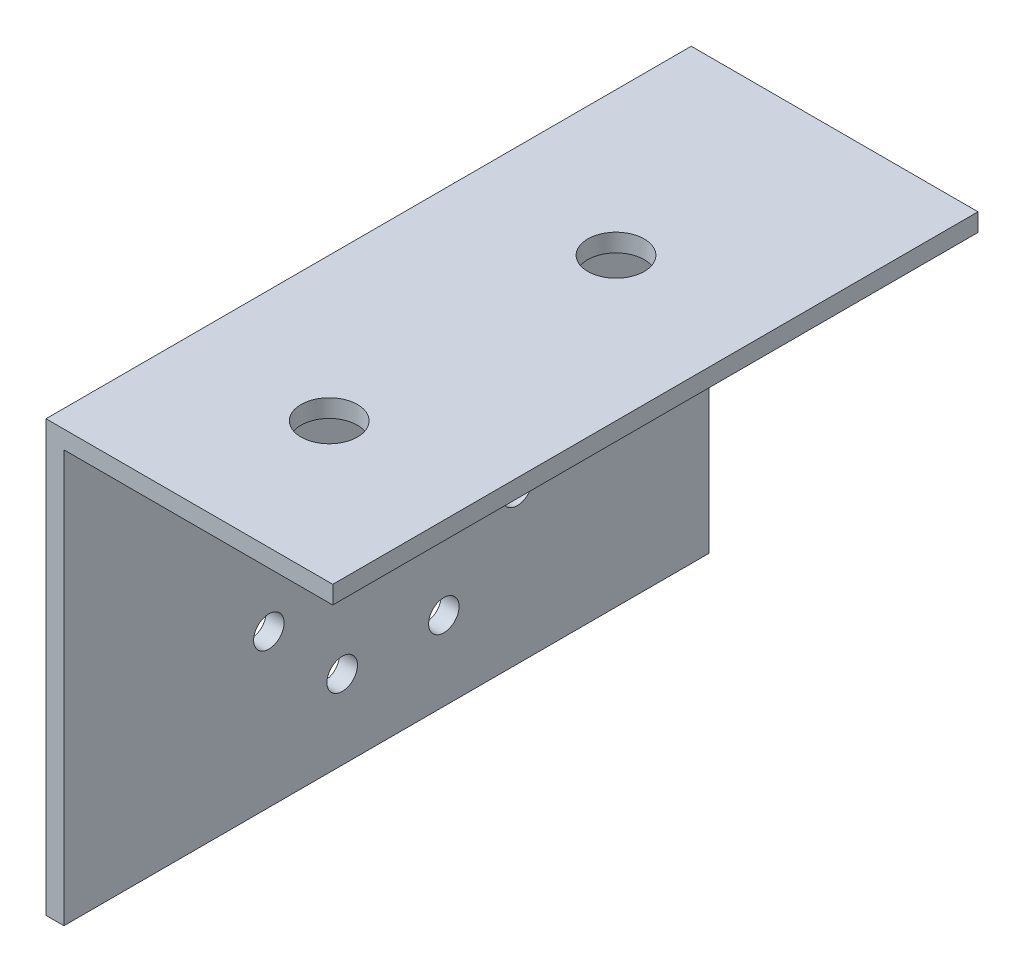
ISO-10303-21;
HEADER;
FILE_DESCRIPTION(('STEP AP214'),'2;1');
FILE_NAME('part.step','',(''),(''),'','','');
FILE_SCHEMA(('AUTOMOTIVE_DESIGN { 1 0 10303 214 1 1 1 1 }'));
ENDSEC;
DATA;
#1=APPLICATION_CONTEXT('core data for automotive mechanical design processes');
#2=APPLICATION_PROTOCOL_DEFINITION('international standard','automotive_design',2000,#1);
#3=PRODUCT_CONTEXT('',#1,'mechanical');
#4=PRODUCT('Part','Part','',(#3));
#5=PRODUCT_RELATED_PRODUCT_CATEGORY('part','',(#4));
#6=PRODUCT_DEFINITION_FORMATION('','',#4);
#7=PRODUCT_DEFINITION_CONTEXT('part definition',#1,'design');
#8=PRODUCT_DEFINITION('design','',#6,#7);
#9=PRODUCT_DEFINITION_SHAPE('','',#8);
#10=(LENGTH_UNIT() NAMED_UNIT(*) SI_UNIT(.MILLI.,.METRE.));
#11=(NAMED_UNIT(*) PLANE_ANGLE_UNIT() SI_UNIT($,.RADIAN.));
#12=(NAMED_UNIT(*) SI_UNIT($,.STERADIAN.) SOLID_ANGLE_UNIT());
#13=UNCERTAINTY_MEASURE_WITH_UNIT(LENGTH_MEASURE(1.E-05),#10,'distance_accuracy_value','');
#14=(GEOMETRIC_REPRESENTATION_CONTEXT(3) GLOBAL_UNCERTAINTY_ASSIGNED_CONTEXT((#13)) GLOBAL_UNIT_ASSIGNED_CONTEXT((#10,
#11,#12)) REPRESENTATION_CONTEXT('',''));
#15=CARTESIAN_POINT('',(0.,0.,0.));
#16=DIRECTION('',(0.,0.,1.));
#17=DIRECTION('',(1.,0.,0.));
#18=AXIS2_PLACEMENT_3D('',#15,#16,#17);
#19=CARTESIAN_POINT('',(-25.6516535121618,-10.7187266461533,57.15));
#20=DIRECTION('',(1.,0.,0.));
#21=DIRECTION('',(0.,0.,-1.));
#22=AXIS2_PLACEMENT_3D('',#19,#20,#21);
#23=PLANE('',#22);
#24=CARTESIAN_POINT('',(-25.6516535121618,-3.71872664615332,32.5));
#25=DIRECTION('',(1.,0.,0.));
#26=DIRECTION('',(0.,0.,-1.));
#27=AXIS2_PLACEMENT_3D('',#24,#25,#26);
#28=CIRCLE('',#27,1.35);
#29=CARTESIAN_POINT('',(-25.6516535121618,-3.71872664615332,31.15));
#30=VERTEX_POINT('',#29);
#31=EDGE_CURVE('E161',#30,#30,#28,.T.);
#32=ORIENTED_EDGE('',*,*,#31,.T.);
#33=EDGE_LOOP('',(#32));
#34=FACE_BOUND('',#33,.T.);
#35=CARTESIAN_POINT('',(-25.6516535121618,-3.71872664615332,23.5));
#36=DIRECTION('',(1.,0.,0.));
#37=DIRECTION('',(0.,0.,-1.));
#38=AXIS2_PLACEMENT_3D('',#35,#36,#37);
#39=CIRCLE('',#38,1.35);
#40=CARTESIAN_POINT('',(-25.6516535121618,-3.71872664615332,22.15));
#41=VERTEX_POINT('',#40);
#42=EDGE_CURVE('E165',#41,#41,#39,.T.);
#43=ORIENTED_EDGE('',*,*,#42,.T.);
#44=EDGE_LOOP('',(#43));
#45=FACE_BOUND('',#44,.T.);
#46=CARTESIAN_POINT('',(-25.6516535121618,2.78127335384669,16.9999999999998));
#47=DIRECTION('',(1.,0.,0.));
#48=DIRECTION('',(0.,0.,-1.));
#49=AXIS2_PLACEMENT_3D('',#46,#47,#48);
#50=CIRCLE('',#49,1.35);
#51=CARTESIAN_POINT('',(-25.6516535121618,2.78127335384669,15.6499999999998));
#52=VERTEX_POINT('',#51);
#53=EDGE_CURVE('E169',#52,#52,#50,.T.);
#54=ORIENTED_EDGE('',*,*,#53,.T.);
#55=EDGE_LOOP('',(#54));
#56=FACE_BOUND('',#55,.T.);
#57=CARTESIAN_POINT('',(-25.6516535121618,11.7812733538467,16.9999999999998));
#58=DIRECTION('',(1.,0.,0.));
#59=DIRECTION('',(0.,0.,-1.));
#60=AXIS2_PLACEMENT_3D('',#57,#58,#59);
#61=CIRCLE('',#60,1.35);
#62=CARTESIAN_POINT('',(-25.6516535121618,11.7812733538467,15.6499999999998));
#63=VERTEX_POINT('',#62);
#64=EDGE_CURVE('E173',#63,#63,#61,.T.);
#65=ORIENTED_EDGE('',*,*,#64,.T.);
#66=EDGE_LOOP('',(#65));
#67=FACE_BOUND('',#66,.T.);
#68=CARTESIAN_POINT('',(-25.6516535121618,18.2812733538467,23.5));
#69=DIRECTION('',(1.,0.,0.));
#70=DIRECTION('',(0.,0.,-1.));
#71=AXIS2_PLACEMENT_3D('',#68,#69,#70);
#72=CIRCLE('',#71,1.35);
#73=CARTESIAN_POINT('',(-25.6516535121618,18.2812733538467,22.15));
#74=VERTEX_POINT('',#73);
#75=EDGE_CURVE('E177',#74,#74,#72,.T.);
#76=ORIENTED_EDGE('',*,*,#75,.T.);
#77=EDGE_LOOP('',(#76));
#78=FACE_BOUND('',#77,.T.);
#79=CARTESIAN_POINT('',(-25.6516535121618,18.2812733538467,32.5));
#80=DIRECTION('',(1.,0.,0.));
#81=DIRECTION('',(0.,0.,-1.));
#82=AXIS2_PLACEMENT_3D('',#79,#80,#81);
#83=CIRCLE('',#82,1.35);
#84=CARTESIAN_POINT('',(-25.6516535121618,18.2812733538467,31.15));
#85=VERTEX_POINT('',#84);
#86=EDGE_CURVE('E181',#85,#85,#83,.T.);
#87=ORIENTED_EDGE('',*,*,#86,.T.);
#88=EDGE_LOOP('',(#87));
#89=FACE_BOUND('',#88,.T.);
#90=CARTESIAN_POINT('',(-25.6516535121618,11.7812733538467,38.9999999999998));
#91=DIRECTION('',(1.,0.,0.));
#92=DIRECTION('',(0.,0.,-1.));
#93=AXIS2_PLACEMENT_3D('',#90,#91,#92);
#94=CIRCLE('',#93,1.35);
#95=CARTESIAN_POINT('',(-25.6516535121618,11.7812733538467,37.6499999999998));
#96=VERTEX_POINT('',#95);
#97=EDGE_CURVE('E185',#96,#96,#94,.T.);
#98=ORIENTED_EDGE('',*,*,#97,.T.);
#99=EDGE_LOOP('',(#98));
#100=FACE_BOUND('',#99,.T.);
#101=CARTESIAN_POINT('',(-25.6516535121618,2.78127335384667,38.9999999999998));
#102=DIRECTION('',(1.,0.,0.));
#103=DIRECTION('',(0.,0.,-1.));
#104=AXIS2_PLACEMENT_3D('',#101,#102,#103);
#105=CIRCLE('',#104,1.35);
#106=CARTESIAN_POINT('',(-25.6516535121618,2.78127335384667,37.6499999999998));
#107=VERTEX_POINT('',#106);
#108=EDGE_CURVE('E119',#107,#107,#105,.T.);
#109=ORIENTED_EDGE('',*,*,#108,.T.);
#110=EDGE_LOOP('',(#109));
#111=FACE_BOUND('',#110,.T.);
#112=DIRECTION('',(0.,-1.,0.));
#113=VECTOR('',#112,1.);
#114=CARTESIAN_POINT('',(-25.6516535121618,-10.7187266461533,0.));
#115=LINE('',#114,#113);
#116=CARTESIAN_POINT('',(-25.6516535121618,27.3812733538467,0.));
#117=VERTEX_POINT('',#116);
#118=CARTESIAN_POINT('',(-25.6516535121618,-10.7187266461533,0.));
#119=VERTEX_POINT('',#118);
#120=EDGE_CURVE('E115',#117,#119,#115,.T.);
#121=ORIENTED_EDGE('',*,*,#120,.T.);
#122=DIRECTION('',(0.,0.,-1.));
#123=VECTOR('',#122,1.);
#124=CARTESIAN_POINT('',(-25.6516535121618,-10.7187266461533,57.15));
#125=LINE('',#124,#123);
#126=CARTESIAN_POINT('',(-25.6516535121618,-10.7187266461533,57.15));
#127=VERTEX_POINT('',#126);
#128=EDGE_CURVE('E11',#127,#119,#125,.T.);
#129=ORIENTED_EDGE('',*,*,#128,.F.);
#130=DIRECTION('',(0.,-1.,0.));
#131=VECTOR('',#130,1.);
#132=CARTESIAN_POINT('',(-25.6516535121618,-10.7187266461533,57.15));
#133=LINE('',#132,#131);
#134=CARTESIAN_POINT('',(-25.6516535121618,27.3812733538467,57.15));
#135=VERTEX_POINT('',#134);
#136=EDGE_CURVE('E126',#135,#127,#133,.T.);
#137=ORIENTED_EDGE('',*,*,#136,.F.);
#138=DIRECTION('',(0.,0.,-1.));
#139=VECTOR('',#138,1.);
#140=CARTESIAN_POINT('',(-25.6516535121618,27.3812733538467,57.15));
#141=LINE('',#140,#139);
#142=EDGE_CURVE('E111',#135,#117,#141,.T.);
#143=ORIENTED_EDGE('',*,*,#142,.T.);
#144=EDGE_LOOP('',(#121,#129,#137,#143));
#145=FACE_BOUND('',#144,.T.);
#146=ADVANCED_FACE('F31',(#34,#45,#56,#67,#78,#89,#100,#111,#145),#23,.F.);
#147=CARTESIAN_POINT('',(-25.6516535121618,-10.7187266461533,57.15));
#148=DIRECTION('',(0.,1.,0.));
#149=DIRECTION('',(0.,0.,1.));
#150=AXIS2_PLACEMENT_3D('',#147,#148,#149);
#151=PLANE('',#150);
#152=DIRECTION('',(1.,0.,0.));
#153=VECTOR('',#152,1.);
#154=CARTESIAN_POINT('',(-25.6516535121618,-10.7187266461533,0.));
#155=LINE('',#154,#153);
#156=CARTESIAN_POINT('',(-24.0641535121618,-10.7187266461533,0.));
#157=VERTEX_POINT('',#156);
#158=EDGE_CURVE('E118',#119,#157,#155,.T.);
#159=ORIENTED_EDGE('',*,*,#158,.T.);
#160=DIRECTION('',(0.,0.,-1.));
#161=VECTOR('',#160,1.);
#162=CARTESIAN_POINT('',(-24.0641535121618,-10.7187266461533,57.15));
#163=LINE('',#162,#161);
#164=CARTESIAN_POINT('',(-24.0641535121618,-10.7187266461533,57.15));
#165=VERTEX_POINT('',#164);
#166=EDGE_CURVE('E39',#165,#157,#163,.T.);
#167=ORIENTED_EDGE('',*,*,#166,.F.);
#168=DIRECTION('',(1.,0.,0.));
#169=VECTOR('',#168,1.);
#170=CARTESIAN_POINT('',(-25.6516535121618,-10.7187266461533,57.15));
#171=LINE('',#170,#169);
#172=EDGE_CURVE('E84',#127,#165,#171,.T.);
#173=ORIENTED_EDGE('',*,*,#172,.F.);
#174=ORIENTED_EDGE('',*,*,#128,.T.);
#175=EDGE_LOOP('',(#159,#167,#173,#174));
#176=FACE_BOUND('',#175,.T.);
#177=ADVANCED_FACE('F153',(#176),#151,.F.);
#178=CARTESIAN_POINT('',(-24.0641535121618,-10.7187266461533,57.15));
#179=DIRECTION('',(-1.,0.,0.));
#180=DIRECTION('',(0.,0.,1.));
#181=AXIS2_PLACEMENT_3D('',#178,#179,#180);
#182=PLANE('',#181);
#183=CARTESIAN_POINT('',(-24.0641535121618,-3.71872664615332,32.5));
#184=DIRECTION('',(1.,0.,0.));
#185=DIRECTION('',(0.,0.,-1.));
#186=AXIS2_PLACEMENT_3D('',#183,#184,#185);
#187=CIRCLE('',#186,1.35);
#188=CARTESIAN_POINT('',(-24.0641535121618,-3.71872664615332,31.15));
#189=VERTEX_POINT('',#188);
#190=EDGE_CURVE('E218',#189,#189,#187,.T.);
#191=ORIENTED_EDGE('',*,*,#190,.F.);
#192=EDGE_LOOP('',(#191));
#193=FACE_BOUND('',#192,.T.);
#194=CARTESIAN_POINT('',(-24.0641535121618,-3.71872664615332,23.5));
#195=DIRECTION('',(1.,0.,0.));
#196=DIRECTION('',(0.,0.,-1.));
#197=AXIS2_PLACEMENT_3D('',#194,#195,#196);
#198=CIRCLE('',#197,1.35);
#199=CARTESIAN_POINT('',(-24.0641535121618,-3.71872664615332,22.15));
#200=VERTEX_POINT('',#199);
#201=EDGE_CURVE('E214',#200,#200,#198,.T.);
#202=ORIENTED_EDGE('',*,*,#201,.F.);
#203=EDGE_LOOP('',(#202));
#204=FACE_BOUND('',#203,.T.);
#205=CARTESIAN_POINT('',(-24.0641535121618,2.78127335384669,16.9999999999998));
#206=DIRECTION('',(1.,0.,0.));
#207=DIRECTION('',(0.,0.,-1.));
#208=AXIS2_PLACEMENT_3D('',#205,#206,#207);
#209=CIRCLE('',#208,1.35);
#210=CARTESIAN_POINT('',(-24.0641535121618,2.78127335384669,15.6499999999998));
#211=VERTEX_POINT('',#210);
#212=EDGE_CURVE('E210',#211,#211,#209,.T.);
#213=ORIENTED_EDGE('',*,*,#212,.F.);
#214=EDGE_LOOP('',(#213));
#215=FACE_BOUND('',#214,.T.);
#216=CARTESIAN_POINT('',(-24.0641535121618,11.7812733538467,16.9999999999998));
#217=DIRECTION('',(1.,0.,0.));
#218=DIRECTION('',(0.,0.,-1.));
#219=AXIS2_PLACEMENT_3D('',#216,#217,#218);
#220=CIRCLE('',#219,1.35);
#221=CARTESIAN_POINT('',(-24.0641535121618,11.7812733538467,15.6499999999998));
#222=VERTEX_POINT('',#221);
#223=EDGE_CURVE('E206',#222,#222,#220,.T.);
#224=ORIENTED_EDGE('',*,*,#223,.F.);
#225=EDGE_LOOP('',(#224));
#226=FACE_BOUND('',#225,.T.);
#227=CARTESIAN_POINT('',(-24.0641535121618,18.2812733538467,23.5));
#228=DIRECTION('',(1.,0.,0.));
#229=DIRECTION('',(0.,0.,-1.));
#230=AXIS2_PLACEMENT_3D('',#227,#228,#229);
#231=CIRCLE('',#230,1.35);
#232=CARTESIAN_POINT('',(-24.0641535121618,18.2812733538467,22.15));
#233=VERTEX_POINT('',#232);
#234=EDGE_CURVE('E202',#233,#233,#231,.T.);
#235=ORIENTED_EDGE('',*,*,#234,.F.);
#236=EDGE_LOOP('',(#235));
#237=FACE_BOUND('',#236,.T.);
#238=CARTESIAN_POINT('',(-24.0641535121618,18.2812733538467,32.5));
#239=DIRECTION('',(1.,0.,0.));
#240=DIRECTION('',(0.,0.,-1.));
#241=AXIS2_PLACEMENT_3D('',#238,#239,#240);
#242=CIRCLE('',#241,1.35);
#243=CARTESIAN_POINT('',(-24.0641535121618,18.2812733538467,31.15));
#244=VERTEX_POINT('',#243);
#245=EDGE_CURVE('E198',#244,#244,#242,.T.);
#246=ORIENTED_EDGE('',*,*,#245,.F.);
#247=EDGE_LOOP('',(#246));
#248=FACE_BOUND('',#247,.T.);
#249=CARTESIAN_POINT('',(-24.0641535121618,11.7812733538467,38.9999999999998));
#250=DIRECTION('',(1.,0.,0.));
#251=DIRECTION('',(0.,0.,-1.));
#252=AXIS2_PLACEMENT_3D('',#249,#250,#251);
#253=CIRCLE('',#252,1.35);
#254=CARTESIAN_POINT('',(-24.0641535121618,11.7812733538467,37.6499999999998));
#255=VERTEX_POINT('',#254);
#256=EDGE_CURVE('E192',#255,#255,#253,.T.);
#257=ORIENTED_EDGE('',*,*,#256,.F.);
#258=EDGE_LOOP('',(#257));
#259=FACE_BOUND('',#258,.T.);
#260=CARTESIAN_POINT('',(-24.0641535121618,2.78127335384667,38.9999999999998));
#261=DIRECTION('',(1.,0.,0.));
#262=DIRECTION('',(0.,0.,-1.));
#263=AXIS2_PLACEMENT_3D('',#260,#261,#262);
#264=CIRCLE('',#263,1.35);
#265=CARTESIAN_POINT('',(-24.0641535121618,2.78127335384667,37.6499999999998));
#266=VERTEX_POINT('',#265);
#267=EDGE_CURVE('E189',#266,#266,#264,.T.);
#268=ORIENTED_EDGE('',*,*,#267,.F.);
#269=EDGE_LOOP('',(#268));
#270=FACE_BOUND('',#269,.T.);
#271=DIRECTION('',(0.,1.,0.));
#272=VECTOR('',#271,1.);
#273=CARTESIAN_POINT('',(-24.0641535121618,-10.7187266461533,0.));
#274=LINE('',#273,#272);
#275=CARTESIAN_POINT('',(-24.0641535121618,25.7937733538467,0.));
#276=VERTEX_POINT('',#275);
#277=EDGE_CURVE('E121',#157,#276,#274,.T.);
#278=ORIENTED_EDGE('',*,*,#277,.T.);
#279=DIRECTION('',(0.,0.,-1.));
#280=VECTOR('',#279,1.);
#281=CARTESIAN_POINT('',(-24.0641535121618,25.7937733538467,57.15));
#282=LINE('',#281,#280);
#283=CARTESIAN_POINT('',(-24.0641535121618,25.7937733538467,57.15));
#284=VERTEX_POINT('',#283);
#285=EDGE_CURVE('E106',#284,#276,#282,.T.);
#286=ORIENTED_EDGE('',*,*,#285,.F.);
#287=DIRECTION('',(0.,1.,0.));
#288=VECTOR('',#287,1.);
#289=CARTESIAN_POINT('',(-24.0641535121618,-10.7187266461533,57.15));
#290=LINE('',#289,#288);
#291=EDGE_CURVE('E97',#165,#284,#290,.T.);
#292=ORIENTED_EDGE('',*,*,#291,.F.);
#293=ORIENTED_EDGE('',*,*,#166,.T.);
#294=EDGE_LOOP('',(#278,#286,#292,#293));
#295=FACE_BOUND('',#294,.T.);
#296=ADVANCED_FACE('F132',(#193,#204,#215,#226,#237,#248,#259,#270,#295),#182,.F.);
#297=CARTESIAN_POINT('',(-24.0641535121618,25.7937733538467,57.15));
#298=DIRECTION('',(0.,1.,0.));
#299=DIRECTION('',(0.,0.,1.));
#300=AXIS2_PLACEMENT_3D('',#297,#298,#299);
#301=PLANE('',#300);
#302=CARTESIAN_POINT('',(-12.9516535121618,25.7937733538467,19.362965599214));
#303=DIRECTION('',(0.,-1.,0.));
#304=DIRECTION('',(0.,0.,-1.));
#305=AXIS2_PLACEMENT_3D('',#302,#303,#304);
#306=CIRCLE('',#305,2.5);
#307=CARTESIAN_POINT('',(-12.9516535121618,25.7937733538467,16.862965599214));
#308=VERTEX_POINT('',#307);
#309=EDGE_CURVE('E231',#308,#308,#306,.T.);
#310=ORIENTED_EDGE('',*,*,#309,.F.);
#311=EDGE_LOOP('',(#310));
#312=FACE_BOUND('',#311,.T.);
#313=CARTESIAN_POINT('',(-12.9516535121618,25.7937733538467,44.762965599214));
#314=DIRECTION('',(0.,-1.,0.));
#315=DIRECTION('',(0.,0.,-1.));
#316=AXIS2_PLACEMENT_3D('',#313,#314,#315);
#317=CIRCLE('',#316,2.5);
#318=CARTESIAN_POINT('',(-12.9516535121618,25.7937733538467,42.262965599214));
#319=VERTEX_POINT('',#318);
#320=EDGE_CURVE('E225',#319,#319,#317,.T.);
#321=ORIENTED_EDGE('',*,*,#320,.F.);
#322=EDGE_LOOP('',(#321));
#323=FACE_BOUND('',#322,.T.);
#324=DIRECTION('',(1.,0.,0.));
#325=VECTOR('',#324,1.);
#326=CARTESIAN_POINT('',(-24.0641535121618,25.7937733538467,0.));
#327=LINE('',#326,#325);
#328=CARTESIAN_POINT('',(-0.251653512161782,25.7937733538467,0.));
#329=VERTEX_POINT('',#328);
#330=EDGE_CURVE('E105',#276,#329,#327,.T.);
#331=ORIENTED_EDGE('',*,*,#330,.T.);
#332=DIRECTION('',(0.,0.,-1.));
#333=VECTOR('',#332,1.);
#334=CARTESIAN_POINT('',(-0.251653512161782,25.7937733538467,57.15));
#335=LINE('',#334,#333);
#336=CARTESIAN_POINT('',(-0.251653512161782,25.7937733538467,57.15));
#337=VERTEX_POINT('',#336);
#338=EDGE_CURVE('E102',#337,#329,#335,.T.);
#339=ORIENTED_EDGE('',*,*,#338,.F.);
#340=DIRECTION('',(1.,0.,0.));
#341=VECTOR('',#340,1.);
#342=CARTESIAN_POINT('',(-24.0641535121618,25.7937733538467,57.15));
#343=LINE('',#342,#341);
#344=EDGE_CURVE('E91',#284,#337,#343,.T.);
#345=ORIENTED_EDGE('',*,*,#344,.F.);
#346=ORIENTED_EDGE('',*,*,#285,.T.);
#347=EDGE_LOOP('',(#331,#339,#345,#346));
#348=FACE_BOUND('',#347,.T.);
#349=ADVANCED_FACE('F103',(#312,#323,#348),#301,.F.);
#350=CARTESIAN_POINT('',(-0.251653512161783,27.3812733538467,57.15));
#351=DIRECTION('',(-1.,0.,0.));
#352=DIRECTION('',(0.,-1.,0.));
#353=AXIS2_PLACEMENT_3D('',#350,#351,#352);
#354=PLANE('',#353);
#355=DIRECTION('',(0.,1.,0.));
#356=VECTOR('',#355,1.);
#357=CARTESIAN_POINT('',(-0.251653512161783,27.3812733538467,0.));
#358=LINE('',#357,#356);
#359=CARTESIAN_POINT('',(-0.251653512161783,27.3812733538467,0.));
#360=VERTEX_POINT('',#359);
#361=EDGE_CURVE('E70',#329,#360,#358,.T.);
#362=ORIENTED_EDGE('',*,*,#361,.T.);
#363=DIRECTION('',(0.,0.,-1.));
#364=VECTOR('',#363,1.);
#365=CARTESIAN_POINT('',(-0.251653512161783,27.3812733538467,57.15));
#366=LINE('',#365,#364);
#367=CARTESIAN_POINT('',(-0.251653512161783,27.3812733538467,57.15));
#368=VERTEX_POINT('',#367);
#369=EDGE_CURVE('E107',#368,#360,#366,.T.);
#370=ORIENTED_EDGE('',*,*,#369,.F.);
#371=DIRECTION('',(0.,1.,0.));
#372=VECTOR('',#371,1.);
#373=CARTESIAN_POINT('',(-0.251653512161783,27.3812733538467,57.15));
#374=LINE('',#373,#372);
#375=EDGE_CURVE('E95',#337,#368,#374,.T.);
#376=ORIENTED_EDGE('',*,*,#375,.F.);
#377=ORIENTED_EDGE('',*,*,#338,.T.);
#378=EDGE_LOOP('',(#362,#370,#376,#377));
#379=FACE_BOUND('',#378,.T.);
#380=ADVANCED_FACE('F109',(#379),#354,.F.);
#381=CARTESIAN_POINT('',(-0.251653512161783,27.3812733538467,57.15));
#382=DIRECTION('',(0.,-1.,0.));
#383=DIRECTION('',(1.,0.,0.));
#384=AXIS2_PLACEMENT_3D('',#381,#382,#383);
#385=PLANE('',#384);
#386=CARTESIAN_POINT('',(-12.9516535121618,27.3812733538467,19.362965599214));
#387=DIRECTION('',(0.,-1.,0.));
#388=DIRECTION('',(0.,0.,-1.));
#389=AXIS2_PLACEMENT_3D('',#386,#387,#388);
#390=CIRCLE('',#389,2.5);
#391=CARTESIAN_POINT('',(-12.9516535121618,27.3812733538467,16.862965599214));
#392=VERTEX_POINT('',#391);
#393=EDGE_CURVE('E228',#392,#392,#390,.T.);
#394=ORIENTED_EDGE('',*,*,#393,.T.);
#395=EDGE_LOOP('',(#394));
#396=FACE_BOUND('',#395,.T.);
#397=CARTESIAN_POINT('',(-12.9516535121618,27.3812733538467,44.762965599214));
#398=DIRECTION('',(0.,-1.,0.));
#399=DIRECTION('',(0.,0.,-1.));
#400=AXIS2_PLACEMENT_3D('',#397,#398,#399);
#401=CIRCLE('',#400,2.5);
#402=CARTESIAN_POINT('',(-12.9516535121618,27.3812733538467,42.262965599214));
#403=VERTEX_POINT('',#402);
#404=EDGE_CURVE('E222',#403,#403,#401,.T.);
#405=ORIENTED_EDGE('',*,*,#404,.T.);
#406=EDGE_LOOP('',(#405));
#407=FACE_BOUND('',#406,.T.);
#408=DIRECTION('',(-1.,0.,0.));
#409=VECTOR('',#408,1.);
#410=CARTESIAN_POINT('',(-0.251653512161783,27.3812733538467,0.));
#411=LINE('',#410,#409);
#412=EDGE_CURVE('E76',#360,#117,#411,.T.);
#413=ORIENTED_EDGE('',*,*,#412,.T.);
#414=ORIENTED_EDGE('',*,*,#142,.F.);
#415=DIRECTION('',(-1.,0.,0.));
#416=VECTOR('',#415,1.);
#417=CARTESIAN_POINT('',(-0.251653512161783,27.3812733538467,57.15));
#418=LINE('',#417,#416);
#419=EDGE_CURVE('E47',#368,#135,#418,.T.);
#420=ORIENTED_EDGE('',*,*,#419,.F.);
#421=ORIENTED_EDGE('',*,*,#369,.T.);
#422=EDGE_LOOP('',(#413,#414,#420,#421));
#423=FACE_BOUND('',#422,.T.);
#424=ADVANCED_FACE('F139',(#396,#407,#423),#385,.F.);
#425=CARTESIAN_POINT('',(-25.6516535121618,27.3812733538467,57.15));
#426=DIRECTION('',(0.,0.,1.));
#427=DIRECTION('',(1.,0.,0.));
#428=AXIS2_PLACEMENT_3D('',#425,#426,#427);
#429=PLANE('',#428);
#430=ORIENTED_EDGE('',*,*,#136,.T.);
#431=ORIENTED_EDGE('',*,*,#172,.T.);
#432=ORIENTED_EDGE('',*,*,#291,.T.);
#433=ORIENTED_EDGE('',*,*,#344,.T.);
#434=ORIENTED_EDGE('',*,*,#375,.T.);
#435=ORIENTED_EDGE('',*,*,#419,.T.);
#436=EDGE_LOOP('',(#430,#431,#432,#433,#434,#435));
#437=FACE_BOUND('',#436,.T.);
#438=ADVANCED_FACE('F93',(#437),#429,.T.);
#439=CARTESIAN_POINT('',(-25.6516535121618,27.3812733538467,0.));
#440=DIRECTION('',(0.,0.,1.));
#441=DIRECTION('',(1.,0.,0.));
#442=AXIS2_PLACEMENT_3D('',#439,#440,#441);
#443=PLANE('',#442);
#444=ORIENTED_EDGE('',*,*,#120,.F.);
#445=ORIENTED_EDGE('',*,*,#412,.F.);
#446=ORIENTED_EDGE('',*,*,#361,.F.);
#447=ORIENTED_EDGE('',*,*,#330,.F.);
#448=ORIENTED_EDGE('',*,*,#277,.F.);
#449=ORIENTED_EDGE('',*,*,#158,.F.);
#450=EDGE_LOOP('',(#444,#445,#446,#447,#448,#449));
#451=FACE_BOUND('',#450,.T.);
#452=ADVANCED_FACE('F135',(#451),#443,.F.);
#453=CARTESIAN_POINT('',(-25.6516535121618,2.78127335384667,38.9999999999998));
#454=DIRECTION('',(1.,0.,0.));
#455=DIRECTION('',(0.,0.,-1.));
#456=AXIS2_PLACEMENT_3D('',#453,#454,#455);
#457=CYLINDRICAL_SURFACE('',#456,1.35);
#458=ORIENTED_EDGE('',*,*,#108,.F.);
#459=EDGE_LOOP('',(#458));
#460=FACE_BOUND('',#459,.T.);
#461=ORIENTED_EDGE('',*,*,#267,.T.);
#462=EDGE_LOOP('',(#461));
#463=FACE_BOUND('',#462,.T.);
#464=ADVANCED_FACE('F282',(#460,#463),#457,.F.);
#465=CARTESIAN_POINT('',(-25.6516535121618,11.7812733538467,38.9999999999998));
#466=DIRECTION('',(1.,0.,0.));
#467=DIRECTION('',(0.,0.,-1.));
#468=AXIS2_PLACEMENT_3D('',#465,#466,#467);
#469=CYLINDRICAL_SURFACE('',#468,1.35);
#470=ORIENTED_EDGE('',*,*,#97,.F.);
#471=EDGE_LOOP('',(#470));
#472=FACE_BOUND('',#471,.T.);
#473=ORIENTED_EDGE('',*,*,#256,.T.);
#474=EDGE_LOOP('',(#473));
#475=FACE_BOUND('',#474,.T.);
#476=ADVANCED_FACE('F278',(#472,#475),#469,.F.);
#477=CARTESIAN_POINT('',(-25.6516535121618,18.2812733538467,32.5));
#478=DIRECTION('',(1.,0.,0.));
#479=DIRECTION('',(0.,0.,-1.));
#480=AXIS2_PLACEMENT_3D('',#477,#478,#479);
#481=CYLINDRICAL_SURFACE('',#480,1.35);
#482=ORIENTED_EDGE('',*,*,#86,.F.);
#483=EDGE_LOOP('',(#482));
#484=FACE_BOUND('',#483,.T.);
#485=ORIENTED_EDGE('',*,*,#245,.T.);
#486=EDGE_LOOP('',(#485));
#487=FACE_BOUND('',#486,.T.);
#488=ADVANCED_FACE('F274',(#484,#487),#481,.F.);
#489=CARTESIAN_POINT('',(-25.6516535121618,18.2812733538467,23.5));
#490=DIRECTION('',(1.,0.,0.));
#491=DIRECTION('',(0.,0.,-1.));
#492=AXIS2_PLACEMENT_3D('',#489,#490,#491);
#493=CYLINDRICAL_SURFACE('',#492,1.35);
#494=ORIENTED_EDGE('',*,*,#75,.F.);
#495=EDGE_LOOP('',(#494));
#496=FACE_BOUND('',#495,.T.);
#497=ORIENTED_EDGE('',*,*,#234,.T.);
#498=EDGE_LOOP('',(#497));
#499=FACE_BOUND('',#498,.T.);
#500=ADVANCED_FACE('F270',(#496,#499),#493,.F.);
#501=CARTESIAN_POINT('',(-25.6516535121618,11.7812733538467,16.9999999999998));
#502=DIRECTION('',(1.,0.,0.));
#503=DIRECTION('',(0.,0.,-1.));
#504=AXIS2_PLACEMENT_3D('',#501,#502,#503);
#505=CYLINDRICAL_SURFACE('',#504,1.35);
#506=ORIENTED_EDGE('',*,*,#64,.F.);
#507=EDGE_LOOP('',(#506));
#508=FACE_BOUND('',#507,.T.);
#509=ORIENTED_EDGE('',*,*,#223,.T.);
#510=EDGE_LOOP('',(#509));
#511=FACE_BOUND('',#510,.T.);
#512=ADVANCED_FACE('F266',(#508,#511),#505,.F.);
#513=CARTESIAN_POINT('',(-25.6516535121618,2.78127335384669,16.9999999999998));
#514=DIRECTION('',(1.,0.,0.));
#515=DIRECTION('',(0.,0.,-1.));
#516=AXIS2_PLACEMENT_3D('',#513,#514,#515);
#517=CYLINDRICAL_SURFACE('',#516,1.35);
#518=ORIENTED_EDGE('',*,*,#53,.F.);
#519=EDGE_LOOP('',(#518));
#520=FACE_BOUND('',#519,.T.);
#521=ORIENTED_EDGE('',*,*,#212,.T.);
#522=EDGE_LOOP('',(#521));
#523=FACE_BOUND('',#522,.T.);
#524=ADVANCED_FACE('F262',(#520,#523),#517,.F.);
#525=CARTESIAN_POINT('',(-25.6516535121618,-3.71872664615332,23.5));
#526=DIRECTION('',(1.,0.,0.));
#527=DIRECTION('',(0.,0.,-1.));
#528=AXIS2_PLACEMENT_3D('',#525,#526,#527);
#529=CYLINDRICAL_SURFACE('',#528,1.35);
#530=ORIENTED_EDGE('',*,*,#42,.F.);
#531=EDGE_LOOP('',(#530));
#532=FACE_BOUND('',#531,.T.);
#533=ORIENTED_EDGE('',*,*,#201,.T.);
#534=EDGE_LOOP('',(#533));
#535=FACE_BOUND('',#534,.T.);
#536=ADVANCED_FACE('F255',(#532,#535),#529,.F.);
#537=CARTESIAN_POINT('',(-25.6516535121618,-3.71872664615332,32.5));
#538=DIRECTION('',(1.,0.,0.));
#539=DIRECTION('',(0.,0.,-1.));
#540=AXIS2_PLACEMENT_3D('',#537,#538,#539);
#541=CYLINDRICAL_SURFACE('',#540,1.35);
#542=ORIENTED_EDGE('',*,*,#31,.F.);
#543=EDGE_LOOP('',(#542));
#544=FACE_BOUND('',#543,.T.);
#545=ORIENTED_EDGE('',*,*,#190,.T.);
#546=EDGE_LOOP('',(#545));
#547=FACE_BOUND('',#546,.T.);
#548=ADVANCED_FACE('F249',(#544,#547),#541,.F.);
#549=CARTESIAN_POINT('',(-12.9516535121618,27.3812733538467,44.762965599214));
#550=DIRECTION('',(0.,-1.,0.));
#551=DIRECTION('',(0.,0.,-1.));
#552=AXIS2_PLACEMENT_3D('',#549,#550,#551);
#553=CYLINDRICAL_SURFACE('',#552,2.5);
#554=ORIENTED_EDGE('',*,*,#404,.F.);
#555=EDGE_LOOP('',(#554));
#556=FACE_BOUND('',#555,.T.);
#557=ORIENTED_EDGE('',*,*,#320,.T.);
#558=EDGE_LOOP('',(#557));
#559=FACE_BOUND('',#558,.T.);
#560=ADVANCED_FACE('F239',(#556,#559),#553,.F.);
#561=CARTESIAN_POINT('',(-12.9516535121618,27.3812733538467,19.362965599214));
#562=DIRECTION('',(0.,-1.,0.));
#563=DIRECTION('',(0.,0.,-1.));
#564=AXIS2_PLACEMENT_3D('',#561,#562,#563);
#565=CYLINDRICAL_SURFACE('',#564,2.5);
#566=ORIENTED_EDGE('',*,*,#393,.F.);
#567=EDGE_LOOP('',(#566));
#568=FACE_BOUND('',#567,.T.);
#569=ORIENTED_EDGE('',*,*,#309,.T.);
#570=EDGE_LOOP('',(#569));
#571=FACE_BOUND('',#570,.T.);
#572=ADVANCED_FACE('F236',(#568,#571),#565,.F.);
#573=CLOSED_SHELL('',(#146,#177,#296,#349,#380,#424,#438,#452,#464,#476,#488,#500,#512,#524,
#536,#548,#560,#572));
#574=MANIFOLD_SOLID_BREP('B2',#573);
#575=ADVANCED_BREP_SHAPE_REPRESENTATION('',(#18,#574),#14);
#576=SHAPE_DEFINITION_REPRESENTATION(#9,#575);
ENDSEC;
END-ISO-10303-21;
